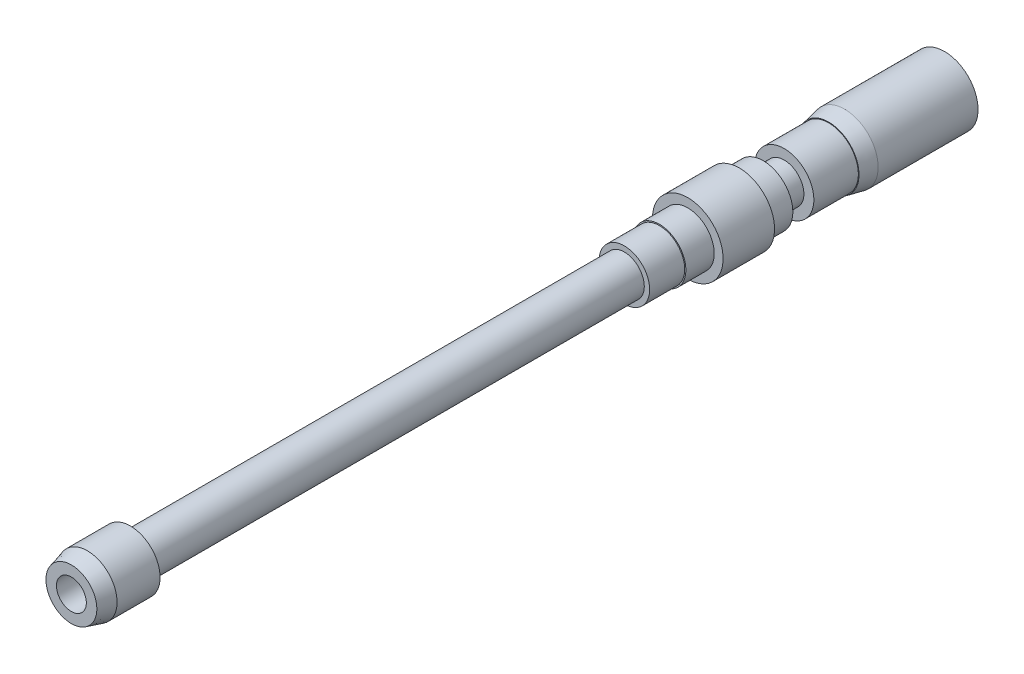
ISO-10303-21;
HEADER;
FILE_DESCRIPTION(('STEP AP214'),'2;1');
FILE_NAME('part.step','',(''),(''),'','','');
FILE_SCHEMA(('AUTOMOTIVE_DESIGN { 1 0 10303 214 1 1 1 1 }'));
ENDSEC;
DATA;
#1=APPLICATION_CONTEXT('core data for automotive mechanical design processes');
#2=APPLICATION_PROTOCOL_DEFINITION('international standard','automotive_design',2000,#1);
#3=PRODUCT_CONTEXT('',#1,'mechanical');
#4=PRODUCT('Part','Part','',(#3));
#5=PRODUCT_RELATED_PRODUCT_CATEGORY('part','',(#4));
#6=PRODUCT_DEFINITION_FORMATION('','',#4);
#7=PRODUCT_DEFINITION_CONTEXT('part definition',#1,'design');
#8=PRODUCT_DEFINITION('design','',#6,#7);
#9=PRODUCT_DEFINITION_SHAPE('','',#8);
#10=(LENGTH_UNIT() NAMED_UNIT(*) SI_UNIT(.MILLI.,.METRE.));
#11=(NAMED_UNIT(*) PLANE_ANGLE_UNIT() SI_UNIT($,.RADIAN.));
#12=(NAMED_UNIT(*) SI_UNIT($,.STERADIAN.) SOLID_ANGLE_UNIT());
#13=UNCERTAINTY_MEASURE_WITH_UNIT(LENGTH_MEASURE(1.E-05),#10,'distance_accuracy_value','');
#14=(GEOMETRIC_REPRESENTATION_CONTEXT(3) GLOBAL_UNCERTAINTY_ASSIGNED_CONTEXT((#13)) GLOBAL_UNIT_ASSIGNED_CONTEXT((#10,
#11,#12)) REPRESENTATION_CONTEXT('',''));
#15=CARTESIAN_POINT('',(0.,0.,0.));
#16=DIRECTION('',(0.,0.,1.));
#17=DIRECTION('',(1.,0.,0.));
#18=AXIS2_PLACEMENT_3D('',#15,#16,#17);
#19=CARTESIAN_POINT('',(0.,0.,-110.2614));
#20=DIRECTION('',(0.,0.,-1.));
#21=DIRECTION('',(-1.,0.,0.));
#22=AXIS2_PLACEMENT_3D('',#19,#20,#21);
#23=PLANE('',#22);
#24=CARTESIAN_POINT('',(0.,0.,-110.2614));
#25=DIRECTION('',(0.,0.,-1.));
#26=DIRECTION('',(-1.,0.,0.));
#27=AXIS2_PLACEMENT_3D('',#24,#25,#26);
#28=CIRCLE('',#27,4.7244);
#29=CARTESIAN_POINT('',(-4.7244,0.,-110.2614));
#30=VERTEX_POINT('',#29);
#31=EDGE_CURVE('E77',#30,#30,#28,.T.);
#32=ORIENTED_EDGE('',*,*,#31,.T.);
#33=EDGE_LOOP('',(#32));
#34=FACE_BOUND('',#33,.T.);
#35=CARTESIAN_POINT('',(0.,0.,-110.2614));
#36=DIRECTION('',(0.,0.,-1.));
#37=DIRECTION('',(-1.,0.,0.));
#38=AXIS2_PLACEMENT_3D('',#35,#36,#37);
#39=CIRCLE('',#38,3.1369);
#40=CARTESIAN_POINT('',(-3.1369,0.,-110.2614));
#41=VERTEX_POINT('',#40);
#42=EDGE_CURVE('E86',#41,#41,#39,.T.);
#43=ORIENTED_EDGE('',*,*,#42,.F.);
#44=EDGE_LOOP('',(#43));
#45=FACE_BOUND('',#44,.T.);
#46=ADVANCED_FACE('F32',(#34,#45),#23,.T.);
#47=CARTESIAN_POINT('',(0.,0.,-106.4514));
#48=DIRECTION('',(0.,0.,-1.));
#49=DIRECTION('',(-1.,0.,0.));
#50=AXIS2_PLACEMENT_3D('',#47,#48,#49);
#51=PLANE('',#50);
#52=CARTESIAN_POINT('',(0.,0.,-106.4514));
#53=DIRECTION('',(0.,0.,-1.));
#54=DIRECTION('',(-1.,0.,0.));
#55=AXIS2_PLACEMENT_3D('',#52,#53,#54);
#56=CIRCLE('',#55,5.6261);
#57=CARTESIAN_POINT('',(-5.6261,0.,-106.4514));
#58=VERTEX_POINT('',#57);
#59=EDGE_CURVE('E71',#58,#58,#56,.T.);
#60=ORIENTED_EDGE('',*,*,#59,.T.);
#61=EDGE_LOOP('',(#60));
#62=FACE_BOUND('',#61,.T.);
#63=CARTESIAN_POINT('',(0.,0.,-106.4514));
#64=DIRECTION('',(0.,0.,-1.));
#65=DIRECTION('',(-1.,0.,0.));
#66=AXIS2_PLACEMENT_3D('',#63,#64,#65);
#67=CIRCLE('',#66,4.7244);
#68=CARTESIAN_POINT('',(-4.7244,0.,-106.4514));
#69=VERTEX_POINT('',#68);
#70=EDGE_CURVE('E80',#69,#69,#67,.T.);
#71=ORIENTED_EDGE('',*,*,#70,.F.);
#72=EDGE_LOOP('',(#71));
#73=FACE_BOUND('',#72,.T.);
#74=ADVANCED_FACE('F126',(#62,#73),#51,.T.);
#75=CARTESIAN_POINT('',(0.,0.,-9.398));
#76=DIRECTION('',(0.,0.,1.));
#77=DIRECTION('',(1.,0.,0.));
#78=AXIS2_PLACEMENT_3D('',#75,#76,#77);
#79=PLANE('',#78);
#80=CARTESIAN_POINT('',(0.,0.,-9.398));
#81=DIRECTION('',(0.,0.,1.));
#82=DIRECTION('',(1.,0.,0.));
#83=AXIS2_PLACEMENT_3D('',#80,#81,#82);
#84=CIRCLE('',#83,4.7371);
#85=CARTESIAN_POINT('',(4.7371,0.,-9.398));
#86=VERTEX_POINT('',#85);
#87=EDGE_CURVE('E55',#86,#86,#84,.T.);
#88=ORIENTED_EDGE('',*,*,#87,.F.);
#89=EDGE_LOOP('',(#88));
#90=FACE_BOUND('',#89,.T.);
#91=CARTESIAN_POINT('',(0.,0.,-9.398));
#92=DIRECTION('',(0.,0.,1.));
#93=DIRECTION('',(1.,0.,0.));
#94=AXIS2_PLACEMENT_3D('',#91,#92,#93);
#95=CIRCLE('',#94,3.175);
#96=CARTESIAN_POINT('',(3.175,0.,-9.398));
#97=VERTEX_POINT('',#96);
#98=EDGE_CURVE('E52',#97,#97,#95,.F.);
#99=ORIENTED_EDGE('',*,*,#98,.F.);
#100=EDGE_LOOP('',(#99));
#101=FACE_BOUND('',#100,.T.);
#102=ADVANCED_FACE('F122',(#90,#101),#79,.F.);
#103=CARTESIAN_POINT('',(0.,0.,-9.398));
#104=DIRECTION('',(0.,0.,1.));
#105=DIRECTION('',(1.,0.,0.));
#106=AXIS2_PLACEMENT_3D('',#103,#104,#105);
#107=CYLINDRICAL_SURFACE('',#106,4.7371);
#108=CARTESIAN_POINT('',(0.,0.,-2.54000000000012));
#109=DIRECTION('',(0.,0.,1.));
#110=DIRECTION('',(1.,0.,0.));
#111=AXIS2_PLACEMENT_3D('',#108,#109,#110);
#112=CIRCLE('',#111,4.7371);
#113=CARTESIAN_POINT('',(4.7371,0.,-2.54000000000012));
#114=VERTEX_POINT('',#113);
#115=EDGE_CURVE('E10',#114,#114,#112,.F.);
#116=ORIENTED_EDGE('',*,*,#115,.T.);
#117=EDGE_LOOP('',(#116));
#118=FACE_BOUND('',#117,.T.);
#119=ORIENTED_EDGE('',*,*,#87,.T.);
#120=EDGE_LOOP('',(#119));
#121=FACE_BOUND('',#120,.T.);
#122=ADVANCED_FACE('F113',(#118,#121),#107,.T.);
#123=CARTESIAN_POINT('',(0.,0.,0.));
#124=DIRECTION('',(0.,0.,1.));
#125=DIRECTION('',(1.,0.,0.));
#126=AXIS2_PLACEMENT_3D('',#123,#124,#125);
#127=PLANE('',#126);
#128=CARTESIAN_POINT('',(0.,0.,0.));
#129=DIRECTION('',(0.,0.,1.));
#130=DIRECTION('',(1.,0.,0.));
#131=AXIS2_PLACEMENT_3D('',#128,#129,#130);
#132=CIRCLE('',#131,2.38125);
#133=CARTESIAN_POINT('',(2.38125,0.,0.));
#134=VERTEX_POINT('',#133);
#135=EDGE_CURVE('E103',#134,#134,#132,.T.);
#136=ORIENTED_EDGE('',*,*,#135,.F.);
#137=EDGE_LOOP('',(#136));
#138=FACE_BOUND('',#137,.T.);
#139=CARTESIAN_POINT('',(0.,0.,0.));
#140=DIRECTION('',(0.,0.,1.));
#141=DIRECTION('',(1.,0.,0.));
#142=AXIS2_PLACEMENT_3D('',#139,#140,#141);
#143=CIRCLE('',#142,4.05650905122492);
#144=CARTESIAN_POINT('',(4.05650905122492,0.,0.));
#145=VERTEX_POINT('',#144);
#146=EDGE_CURVE('E39',#145,#145,#143,.T.);
#147=ORIENTED_EDGE('',*,*,#146,.T.);
#148=EDGE_LOOP('',(#147));
#149=FACE_BOUND('',#148,.T.);
#150=ADVANCED_FACE('F110',(#138,#149),#127,.T.);
#151=CARTESIAN_POINT('',(0.,0.,-88.138));
#152=DIRECTION('',(0.,0.,1.));
#153=DIRECTION('',(1.,0.,0.));
#154=AXIS2_PLACEMENT_3D('',#151,#152,#153);
#155=CYLINDRICAL_SURFACE('',#154,3.175);
#156=CARTESIAN_POINT('',(0.,0.,-88.138));
#157=DIRECTION('',(0.,0.,-1.));
#158=DIRECTION('',(-1.,0.,0.));
#159=AXIS2_PLACEMENT_3D('',#156,#157,#158);
#160=CIRCLE('',#159,3.175);
#161=CARTESIAN_POINT('',(-3.175,0.,-88.138));
#162=VERTEX_POINT('',#161);
#163=EDGE_CURVE('E58',#162,#162,#160,.T.);
#164=ORIENTED_EDGE('',*,*,#163,.F.);
#165=EDGE_LOOP('',(#164));
#166=FACE_BOUND('',#165,.T.);
#167=ORIENTED_EDGE('',*,*,#98,.T.);
#168=EDGE_LOOP('',(#167));
#169=FACE_BOUND('',#168,.T.);
#170=ADVANCED_FACE('F112',(#166,#169),#155,.T.);
#171=CARTESIAN_POINT('',(0.,0.,-88.138));
#172=DIRECTION('',(0.,0.,-1.));
#173=DIRECTION('',(-1.,0.,0.));
#174=AXIS2_PLACEMENT_3D('',#171,#172,#173);
#175=PLANE('',#174);
#176=CARTESIAN_POINT('',(0.,0.,-88.138));
#177=DIRECTION('',(0.,0.,-1.));
#178=DIRECTION('',(-1.,0.,0.));
#179=AXIS2_PLACEMENT_3D('',#176,#177,#178);
#180=CIRCLE('',#179,4.0259);
#181=CARTESIAN_POINT('',(-4.0259,0.,-88.138));
#182=VERTEX_POINT('',#181);
#183=EDGE_CURVE('E62',#182,#182,#180,.T.);
#184=ORIENTED_EDGE('',*,*,#183,.F.);
#185=EDGE_LOOP('',(#184));
#186=FACE_BOUND('',#185,.T.);
#187=ORIENTED_EDGE('',*,*,#163,.T.);
#188=EDGE_LOOP('',(#187));
#189=FACE_BOUND('',#188,.T.);
#190=ADVANCED_FACE('F119',(#186,#189),#175,.F.);
#191=CARTESIAN_POINT('',(0.,0.,-93.726));
#192=DIRECTION('',(0.,0.,1.));
#193=DIRECTION('',(1.,0.,0.));
#194=AXIS2_PLACEMENT_3D('',#191,#192,#193);
#195=CYLINDRICAL_SURFACE('',#194,4.0259);
#196=CARTESIAN_POINT('',(0.,0.,-93.726));
#197=DIRECTION('',(0.,0.,-1.));
#198=DIRECTION('',(-1.,0.,0.));
#199=AXIS2_PLACEMENT_3D('',#196,#197,#198);
#200=CIRCLE('',#199,4.0259);
#201=CARTESIAN_POINT('',(-4.0259,0.,-93.726));
#202=VERTEX_POINT('',#201);
#203=EDGE_CURVE('E61',#202,#202,#200,.T.);
#204=ORIENTED_EDGE('',*,*,#203,.F.);
#205=EDGE_LOOP('',(#204));
#206=FACE_BOUND('',#205,.T.);
#207=ORIENTED_EDGE('',*,*,#183,.T.);
#208=EDGE_LOOP('',(#207));
#209=FACE_BOUND('',#208,.T.);
#210=ADVANCED_FACE('F155',(#206,#209),#195,.T.);
#211=CARTESIAN_POINT('',(0.,0.,-93.726));
#212=DIRECTION('',(0.,0.,-1.));
#213=DIRECTION('',(-1.,0.,0.));
#214=AXIS2_PLACEMENT_3D('',#211,#212,#213);
#215=PLANE('',#214);
#216=CARTESIAN_POINT('',(0.,0.,-93.726));
#217=DIRECTION('',(0.,0.,-1.));
#218=DIRECTION('',(-1.,0.,0.));
#219=AXIS2_PLACEMENT_3D('',#216,#217,#218);
#220=CIRCLE('',#219,4.2164);
#221=CARTESIAN_POINT('',(-4.2164,0.,-93.726));
#222=VERTEX_POINT('',#221);
#223=EDGE_CURVE('E68',#222,#222,#220,.T.);
#224=ORIENTED_EDGE('',*,*,#223,.F.);
#225=EDGE_LOOP('',(#224));
#226=FACE_BOUND('',#225,.T.);
#227=ORIENTED_EDGE('',*,*,#203,.T.);
#228=EDGE_LOOP('',(#227));
#229=FACE_BOUND('',#228,.T.);
#230=ADVANCED_FACE('F152',(#226,#229),#215,.F.);
#231=CARTESIAN_POINT('',(0.,0.,-98.2472));
#232=DIRECTION('',(0.,0.,1.));
#233=DIRECTION('',(1.,0.,0.));
#234=AXIS2_PLACEMENT_3D('',#231,#232,#233);
#235=CYLINDRICAL_SURFACE('',#234,4.2164);
#236=CARTESIAN_POINT('',(0.,0.,-98.2472));
#237=DIRECTION('',(0.,0.,-1.));
#238=DIRECTION('',(-1.,0.,0.));
#239=AXIS2_PLACEMENT_3D('',#236,#237,#238);
#240=CIRCLE('',#239,4.2164);
#241=CARTESIAN_POINT('',(-4.2164,0.,-98.2472));
#242=VERTEX_POINT('',#241);
#243=EDGE_CURVE('E65',#242,#242,#240,.T.);
#244=ORIENTED_EDGE('',*,*,#243,.F.);
#245=EDGE_LOOP('',(#244));
#246=FACE_BOUND('',#245,.T.);
#247=ORIENTED_EDGE('',*,*,#223,.T.);
#248=EDGE_LOOP('',(#247));
#249=FACE_BOUND('',#248,.T.);
#250=ADVANCED_FACE('F147',(#246,#249),#235,.T.);
#251=CARTESIAN_POINT('',(0.,0.,-98.2472));
#252=DIRECTION('',(0.,0.,-1.));
#253=DIRECTION('',(-1.,0.,0.));
#254=AXIS2_PLACEMENT_3D('',#251,#252,#253);
#255=PLANE('',#254);
#256=CARTESIAN_POINT('',(0.,0.,-98.2472));
#257=DIRECTION('',(0.,0.,-1.));
#258=DIRECTION('',(-1.,0.,0.));
#259=AXIS2_PLACEMENT_3D('',#256,#257,#258);
#260=CIRCLE('',#259,5.6261);
#261=CARTESIAN_POINT('',(-5.6261,0.,-98.2472));
#262=VERTEX_POINT('',#261);
#263=EDGE_CURVE('E74',#262,#262,#260,.T.);
#264=ORIENTED_EDGE('',*,*,#263,.F.);
#265=EDGE_LOOP('',(#264));
#266=FACE_BOUND('',#265,.T.);
#267=ORIENTED_EDGE('',*,*,#243,.T.);
#268=EDGE_LOOP('',(#267));
#269=FACE_BOUND('',#268,.T.);
#270=ADVANCED_FACE('F144',(#266,#269),#255,.F.);
#271=CARTESIAN_POINT('',(0.,0.,-106.4514));
#272=DIRECTION('',(0.,0.,1.));
#273=DIRECTION('',(1.,0.,0.));
#274=AXIS2_PLACEMENT_3D('',#271,#272,#273);
#275=CYLINDRICAL_SURFACE('',#274,5.6261);
#276=ORIENTED_EDGE('',*,*,#59,.F.);
#277=EDGE_LOOP('',(#276));
#278=FACE_BOUND('',#277,.T.);
#279=ORIENTED_EDGE('',*,*,#263,.T.);
#280=EDGE_LOOP('',(#279));
#281=FACE_BOUND('',#280,.T.);
#282=ADVANCED_FACE('F141',(#278,#281),#275,.T.);
#283=CARTESIAN_POINT('',(0.,0.,-110.2614));
#284=DIRECTION('',(0.,0.,1.));
#285=DIRECTION('',(1.,0.,0.));
#286=AXIS2_PLACEMENT_3D('',#283,#284,#285);
#287=CYLINDRICAL_SURFACE('',#286,4.7244);
#288=ORIENTED_EDGE('',*,*,#31,.F.);
#289=EDGE_LOOP('',(#288));
#290=FACE_BOUND('',#289,.T.);
#291=ORIENTED_EDGE('',*,*,#70,.T.);
#292=EDGE_LOOP('',(#291));
#293=FACE_BOUND('',#292,.T.);
#294=ADVANCED_FACE('F139',(#290,#293),#287,.T.);
#295=CARTESIAN_POINT('',(0.,0.,-113.6142));
#296=DIRECTION('',(0.,0.,1.));
#297=DIRECTION('',(1.,0.,0.));
#298=AXIS2_PLACEMENT_3D('',#295,#296,#297);
#299=CYLINDRICAL_SURFACE('',#298,3.1369);
#300=CARTESIAN_POINT('',(0.,0.,-113.6142));
#301=DIRECTION('',(0.,0.,-1.));
#302=DIRECTION('',(-1.,0.,0.));
#303=AXIS2_PLACEMENT_3D('',#300,#301,#302);
#304=CIRCLE('',#303,3.1369);
#305=CARTESIAN_POINT('',(-3.1369,0.,-113.6142));
#306=VERTEX_POINT('',#305);
#307=EDGE_CURVE('E83',#306,#306,#304,.T.);
#308=ORIENTED_EDGE('',*,*,#307,.F.);
#309=EDGE_LOOP('',(#308));
#310=FACE_BOUND('',#309,.T.);
#311=ORIENTED_EDGE('',*,*,#42,.T.);
#312=EDGE_LOOP('',(#311));
#313=FACE_BOUND('',#312,.T.);
#314=ADVANCED_FACE('F137',(#310,#313),#299,.T.);
#315=CARTESIAN_POINT('',(0.,0.,-113.6142));
#316=DIRECTION('',(0.,0.,-1.));
#317=DIRECTION('',(-1.,0.,0.));
#318=AXIS2_PLACEMENT_3D('',#315,#316,#317);
#319=PLANE('',#318);
#320=CARTESIAN_POINT('',(0.,0.,-113.6142));
#321=DIRECTION('',(0.,0.,-1.));
#322=DIRECTION('',(-1.,0.,0.));
#323=AXIS2_PLACEMENT_3D('',#320,#321,#322);
#324=CIRCLE('',#323,4.7244);
#325=CARTESIAN_POINT('',(-4.7244,0.,-113.6142));
#326=VERTEX_POINT('',#325);
#327=EDGE_CURVE('E92',#326,#326,#324,.T.);
#328=ORIENTED_EDGE('',*,*,#327,.F.);
#329=EDGE_LOOP('',(#328));
#330=FACE_BOUND('',#329,.T.);
#331=ORIENTED_EDGE('',*,*,#307,.T.);
#332=EDGE_LOOP('',(#331));
#333=FACE_BOUND('',#332,.T.);
#334=ADVANCED_FACE('F252',(#330,#333),#319,.F.);
#335=CARTESIAN_POINT('',(0.,0.,-120.7008));
#336=DIRECTION('',(0.,0.,1.));
#337=DIRECTION('',(1.,0.,0.));
#338=AXIS2_PLACEMENT_3D('',#335,#336,#337);
#339=CYLINDRICAL_SURFACE('',#338,4.7244);
#340=CARTESIAN_POINT('',(0.,0.,-120.7008));
#341=DIRECTION('',(0.,0.,-1.));
#342=DIRECTION('',(-1.,0.,0.));
#343=AXIS2_PLACEMENT_3D('',#340,#341,#342);
#344=CIRCLE('',#343,4.7244);
#345=CARTESIAN_POINT('',(-4.7244,0.,-120.7008));
#346=VERTEX_POINT('',#345);
#347=EDGE_CURVE('E89',#346,#346,#344,.T.);
#348=ORIENTED_EDGE('',*,*,#347,.F.);
#349=EDGE_LOOP('',(#348));
#350=FACE_BOUND('',#349,.T.);
#351=ORIENTED_EDGE('',*,*,#327,.T.);
#352=EDGE_LOOP('',(#351));
#353=FACE_BOUND('',#352,.T.);
#354=ADVANCED_FACE('F242',(#350,#353),#339,.T.);
#355=CARTESIAN_POINT('',(0.,0.,-120.7008));
#356=DIRECTION('',(0.,0.,-1.));
#357=DIRECTION('',(-1.,0.,0.));
#358=AXIS2_PLACEMENT_3D('',#355,#356,#357);
#359=PLANE('',#358);
#360=CARTESIAN_POINT('',(0.,0.,-120.7008));
#361=DIRECTION('',(0.,0.,-1.));
#362=DIRECTION('',(-1.,0.,0.));
#363=AXIS2_PLACEMENT_3D('',#360,#361,#362);
#364=CIRCLE('',#363,4.83869999999997);
#365=CARTESIAN_POINT('',(-4.83869999999997,0.,-120.7008));
#366=VERTEX_POINT('',#365);
#367=EDGE_CURVE('E43',#366,#366,#364,.F.);
#368=ORIENTED_EDGE('',*,*,#367,.T.);
#369=EDGE_LOOP('',(#368));
#370=FACE_BOUND('',#369,.T.);
#371=ORIENTED_EDGE('',*,*,#347,.T.);
#372=EDGE_LOOP('',(#371));
#373=FACE_BOUND('',#372,.T.);
#374=ADVANCED_FACE('F232',(#370,#373),#359,.F.);
#375=CARTESIAN_POINT('',(0.,0.,-139.1666));
#376=DIRECTION('',(0.,0.,1.));
#377=DIRECTION('',(1.,0.,0.));
#378=AXIS2_PLACEMENT_3D('',#375,#376,#377);
#379=CYLINDRICAL_SURFACE('',#378,5.3467);
#380=CARTESIAN_POINT('',(0.,0.,-123.2408));
#381=DIRECTION('',(0.,0.,-1.));
#382=DIRECTION('',(-1.,0.,0.));
#383=AXIS2_PLACEMENT_3D('',#380,#381,#382);
#384=CIRCLE('',#383,5.3467);
#385=CARTESIAN_POINT('',(-5.3467,0.,-123.2408));
#386=VERTEX_POINT('',#385);
#387=EDGE_CURVE('E47',#386,#386,#384,.T.);
#388=ORIENTED_EDGE('',*,*,#387,.T.);
#389=EDGE_LOOP('',(#388));
#390=FACE_BOUND('',#389,.T.);
#391=CARTESIAN_POINT('',(0.,0.,-139.1666));
#392=DIRECTION('',(0.,0.,-1.));
#393=DIRECTION('',(-1.,0.,0.));
#394=AXIS2_PLACEMENT_3D('',#391,#392,#393);
#395=CIRCLE('',#394,5.3467);
#396=CARTESIAN_POINT('',(-5.3467,0.,-139.1666));
#397=VERTEX_POINT('',#396);
#398=EDGE_CURVE('E95',#397,#397,#395,.T.);
#399=ORIENTED_EDGE('',*,*,#398,.F.);
#400=EDGE_LOOP('',(#399));
#401=FACE_BOUND('',#400,.T.);
#402=ADVANCED_FACE('F203',(#390,#401),#379,.T.);
#403=CARTESIAN_POINT('',(0.,0.,-139.1666));
#404=DIRECTION('',(0.,0.,-1.));
#405=DIRECTION('',(-1.,0.,0.));
#406=AXIS2_PLACEMENT_3D('',#403,#404,#405);
#407=PLANE('',#406);
#408=CARTESIAN_POINT('',(0.,0.,-139.1666));
#409=DIRECTION('',(0.,0.,-1.));
#410=DIRECTION('',(-1.,0.,0.));
#411=AXIS2_PLACEMENT_3D('',#408,#409,#410);
#412=CIRCLE('',#411,2.38125);
#413=CARTESIAN_POINT('',(-2.38125,0.,-139.1666));
#414=VERTEX_POINT('',#413);
#415=EDGE_CURVE('E100',#414,#414,#412,.F.);
#416=ORIENTED_EDGE('',*,*,#415,.T.);
#417=EDGE_LOOP('',(#416));
#418=FACE_BOUND('',#417,.T.);
#419=ORIENTED_EDGE('',*,*,#398,.T.);
#420=EDGE_LOOP('',(#419));
#421=FACE_BOUND('',#420,.T.);
#422=ADVANCED_FACE('F197',(#418,#421),#407,.T.);
#423=CARTESIAN_POINT('',(0.,0.,-123.2408));
#424=DIRECTION('',(0.,0.,-1.));
#425=DIRECTION('',(-1.,0.,0.));
#426=AXIS2_PLACEMENT_3D('',#423,#424,#425);
#427=CONICAL_SURFACE('',#426,5.3467,0.197395559849879);
#428=ORIENTED_EDGE('',*,*,#367,.F.);
#429=EDGE_LOOP('',(#428));
#430=FACE_BOUND('',#429,.T.);
#431=ORIENTED_EDGE('',*,*,#387,.F.);
#432=EDGE_LOOP('',(#431));
#433=FACE_BOUND('',#432,.T.);
#434=ADVANCED_FACE('F202',(#430,#433),#427,.T.);
#435=CARTESIAN_POINT('',(0.,0.,0.));
#436=DIRECTION('',(0.,0.,-1.));
#437=DIRECTION('',(-1.,0.,0.));
#438=AXIS2_PLACEMENT_3D('',#435,#436,#437);
#439=CONICAL_SURFACE('',#438,4.05650905122492,0.261799387799148);
#440=ORIENTED_EDGE('',*,*,#115,.F.);
#441=EDGE_LOOP('',(#440));
#442=FACE_BOUND('',#441,.T.);
#443=ORIENTED_EDGE('',*,*,#146,.F.);
#444=EDGE_LOOP('',(#443));
#445=FACE_BOUND('',#444,.T.);
#446=ADVANCED_FACE('F34',(#442,#445),#439,.T.);
#447=CARTESIAN_POINT('',(0.,0.,-145.901792090802));
#448=DIRECTION('',(0.,0.,1.));
#449=DIRECTION('',(1.,0.,0.));
#450=AXIS2_PLACEMENT_3D('',#447,#448,#449);
#451=CYLINDRICAL_SURFACE('',#450,2.38125);
#452=ORIENTED_EDGE('',*,*,#135,.T.);
#453=EDGE_LOOP('',(#452));
#454=FACE_BOUND('',#453,.T.);
#455=ORIENTED_EDGE('',*,*,#415,.F.);
#456=EDGE_LOOP('',(#455));
#457=FACE_BOUND('',#456,.T.);
#458=ADVANCED_FACE('F107',(#454,#457),#451,.F.);
#459=CLOSED_SHELL('',(#46,#74,#102,#122,#150,#170,#190,#210,#230,#250,#270,#282,#294,#314,#334,
#354,#374,#402,#422,#434,#446,#458));
#460=MANIFOLD_SOLID_BREP('B2',#459);
#461=ADVANCED_BREP_SHAPE_REPRESENTATION('',(#18,#460),#14);
#462=SHAPE_DEFINITION_REPRESENTATION(#9,#461);
ENDSEC;
END-ISO-10303-21;
